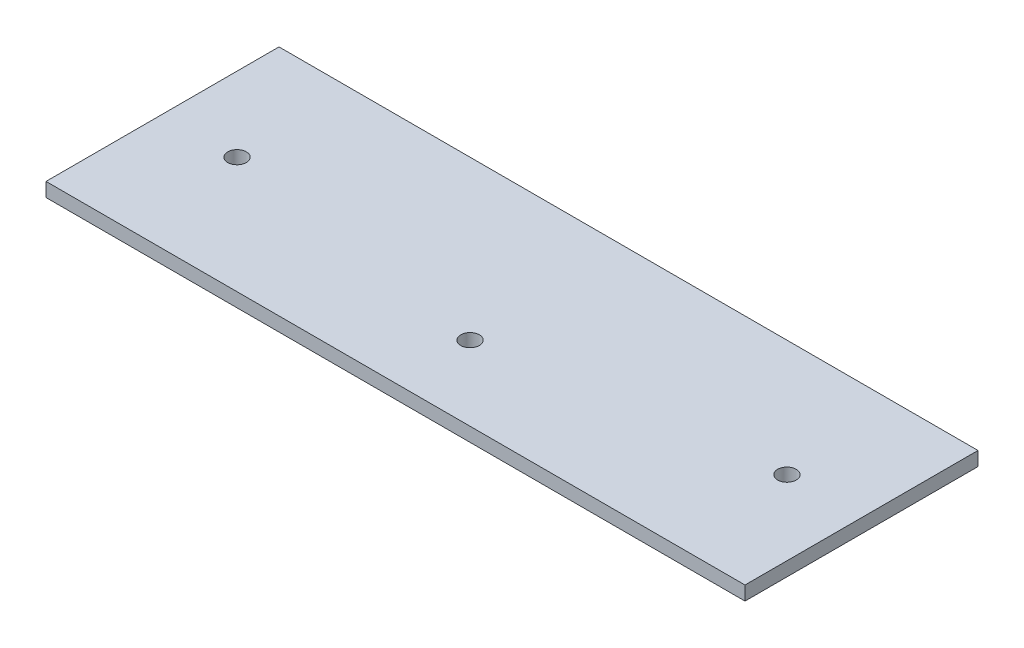
ISO-10303-21;
HEADER;
FILE_DESCRIPTION(('STEP AP214'),'2;1');
FILE_NAME('part.step','',(''),(''),'','','');
FILE_SCHEMA(('AUTOMOTIVE_DESIGN { 1 0 10303 214 1 1 1 1 }'));
ENDSEC;
DATA;
#1=APPLICATION_CONTEXT('core data for automotive mechanical design processes');
#2=APPLICATION_PROTOCOL_DEFINITION('international standard','automotive_design',2000,#1);
#3=PRODUCT_CONTEXT('',#1,'mechanical');
#4=PRODUCT('Part','Part','',(#3));
#5=PRODUCT_RELATED_PRODUCT_CATEGORY('part','',(#4));
#6=PRODUCT_DEFINITION_FORMATION('','',#4);
#7=PRODUCT_DEFINITION_CONTEXT('part definition',#1,'design');
#8=PRODUCT_DEFINITION('design','',#6,#7);
#9=PRODUCT_DEFINITION_SHAPE('','',#8);
#10=(LENGTH_UNIT() NAMED_UNIT(*) SI_UNIT(.MILLI.,.METRE.));
#11=(NAMED_UNIT(*) PLANE_ANGLE_UNIT() SI_UNIT($,.RADIAN.));
#12=(NAMED_UNIT(*) SI_UNIT($,.STERADIAN.) SOLID_ANGLE_UNIT());
#13=UNCERTAINTY_MEASURE_WITH_UNIT(LENGTH_MEASURE(1.E-05),#10,'distance_accuracy_value','');
#14=(GEOMETRIC_REPRESENTATION_CONTEXT(3) GLOBAL_UNCERTAINTY_ASSIGNED_CONTEXT((#13)) GLOBAL_UNIT_ASSIGNED_CONTEXT((#10,
#11,#12)) REPRESENTATION_CONTEXT('',''));
#15=CARTESIAN_POINT('',(0.,0.,0.));
#16=DIRECTION('',(0.,0.,1.));
#17=DIRECTION('',(1.,0.,0.));
#18=AXIS2_PLACEMENT_3D('',#15,#16,#17);
#19=CARTESIAN_POINT('',(-75.,3.,-25.));
#20=DIRECTION('',(1.,0.,0.));
#21=DIRECTION('',(0.,0.,-1.));
#22=AXIS2_PLACEMENT_3D('',#19,#20,#21);
#23=PLANE('',#22);
#24=DIRECTION('',(0.,0.,1.));
#25=VECTOR('',#24,1.);
#26=CARTESIAN_POINT('',(-75.,0.,-25.));
#27=LINE('',#26,#25);
#28=CARTESIAN_POINT('',(-75.,0.,-25.));
#29=VERTEX_POINT('',#28);
#30=CARTESIAN_POINT('',(-75.,0.,25.));
#31=VERTEX_POINT('',#30);
#32=EDGE_CURVE('E98',#29,#31,#27,.T.);
#33=ORIENTED_EDGE('',*,*,#32,.T.);
#34=DIRECTION('',(0.,-1.,0.));
#35=VECTOR('',#34,1.);
#36=CARTESIAN_POINT('',(-75.,3.,25.));
#37=LINE('',#36,#35);
#38=CARTESIAN_POINT('',(-75.,3.,25.));
#39=VERTEX_POINT('',#38);
#40=EDGE_CURVE('E11',#39,#31,#37,.T.);
#41=ORIENTED_EDGE('',*,*,#40,.F.);
#42=DIRECTION('',(0.,0.,1.));
#43=VECTOR('',#42,1.);
#44=CARTESIAN_POINT('',(-75.,3.,-25.));
#45=LINE('',#44,#43);
#46=CARTESIAN_POINT('',(-75.,3.,-25.));
#47=VERTEX_POINT('',#46);
#48=EDGE_CURVE('E86',#47,#39,#45,.T.);
#49=ORIENTED_EDGE('',*,*,#48,.F.);
#50=DIRECTION('',(0.,-1.,0.));
#51=VECTOR('',#50,1.);
#52=CARTESIAN_POINT('',(-75.,3.,-25.));
#53=LINE('',#52,#51);
#54=EDGE_CURVE('E94',#47,#29,#53,.T.);
#55=ORIENTED_EDGE('',*,*,#54,.T.);
#56=EDGE_LOOP('',(#33,#41,#49,#55));
#57=FACE_BOUND('',#56,.T.);
#58=ADVANCED_FACE('F35',(#57),#23,.F.);
#59=CARTESIAN_POINT('',(75.,3.,25.));
#60=DIRECTION('',(0.,0.,-1.));
#61=DIRECTION('',(-1.,0.,0.));
#62=AXIS2_PLACEMENT_3D('',#59,#60,#61);
#63=PLANE('',#62);
#64=DIRECTION('',(1.,0.,0.));
#65=VECTOR('',#64,1.);
#66=CARTESIAN_POINT('',(75.,0.,25.));
#67=LINE('',#66,#65);
#68=CARTESIAN_POINT('',(75.,0.,25.));
#69=VERTEX_POINT('',#68);
#70=EDGE_CURVE('E90',#31,#69,#67,.T.);
#71=ORIENTED_EDGE('',*,*,#70,.T.);
#72=DIRECTION('',(0.,-1.,0.));
#73=VECTOR('',#72,1.);
#74=CARTESIAN_POINT('',(75.,3.,25.));
#75=LINE('',#74,#73);
#76=CARTESIAN_POINT('',(75.,3.,25.));
#77=VERTEX_POINT('',#76);
#78=EDGE_CURVE('E43',#77,#69,#75,.T.);
#79=ORIENTED_EDGE('',*,*,#78,.F.);
#80=DIRECTION('',(1.,0.,0.));
#81=VECTOR('',#80,1.);
#82=CARTESIAN_POINT('',(75.,3.,25.));
#83=LINE('',#82,#81);
#84=EDGE_CURVE('E81',#39,#77,#83,.T.);
#85=ORIENTED_EDGE('',*,*,#84,.F.);
#86=ORIENTED_EDGE('',*,*,#40,.T.);
#87=EDGE_LOOP('',(#71,#79,#85,#86));
#88=FACE_BOUND('',#87,.T.);
#89=ADVANCED_FACE('F89',(#88),#63,.F.);
#90=CARTESIAN_POINT('',(75.,3.,-25.));
#91=DIRECTION('',(-1.,0.,0.));
#92=DIRECTION('',(0.,0.,1.));
#93=AXIS2_PLACEMENT_3D('',#90,#91,#92);
#94=PLANE('',#93);
#95=DIRECTION('',(0.,0.,-1.));
#96=VECTOR('',#95,1.);
#97=CARTESIAN_POINT('',(75.,0.,-25.));
#98=LINE('',#97,#96);
#99=CARTESIAN_POINT('',(75.,0.,-25.));
#100=VERTEX_POINT('',#99);
#101=EDGE_CURVE('E68',#69,#100,#98,.T.);
#102=ORIENTED_EDGE('',*,*,#101,.T.);
#103=DIRECTION('',(0.,-1.,0.));
#104=VECTOR('',#103,1.);
#105=CARTESIAN_POINT('',(75.,3.,-25.));
#106=LINE('',#105,#104);
#107=CARTESIAN_POINT('',(75.,3.,-25.));
#108=VERTEX_POINT('',#107);
#109=EDGE_CURVE('E91',#108,#100,#106,.T.);
#110=ORIENTED_EDGE('',*,*,#109,.F.);
#111=DIRECTION('',(0.,0.,-1.));
#112=VECTOR('',#111,1.);
#113=CARTESIAN_POINT('',(75.,3.,-25.));
#114=LINE('',#113,#112);
#115=EDGE_CURVE('E84',#77,#108,#114,.T.);
#116=ORIENTED_EDGE('',*,*,#115,.F.);
#117=ORIENTED_EDGE('',*,*,#78,.T.);
#118=EDGE_LOOP('',(#102,#110,#116,#117));
#119=FACE_BOUND('',#118,.T.);
#120=ADVANCED_FACE('F92',(#119),#94,.F.);
#121=CARTESIAN_POINT('',(75.,3.,-25.));
#122=DIRECTION('',(0.,0.,1.));
#123=DIRECTION('',(1.,0.,0.));
#124=AXIS2_PLACEMENT_3D('',#121,#122,#123);
#125=PLANE('',#124);
#126=DIRECTION('',(-1.,0.,0.));
#127=VECTOR('',#126,1.);
#128=CARTESIAN_POINT('',(75.,0.,-25.));
#129=LINE('',#128,#127);
#130=EDGE_CURVE('E74',#100,#29,#129,.T.);
#131=ORIENTED_EDGE('',*,*,#130,.T.);
#132=ORIENTED_EDGE('',*,*,#54,.F.);
#133=DIRECTION('',(-1.,0.,0.));
#134=VECTOR('',#133,1.);
#135=CARTESIAN_POINT('',(75.,3.,-25.));
#136=LINE('',#135,#134);
#137=EDGE_CURVE('E51',#108,#47,#136,.T.);
#138=ORIENTED_EDGE('',*,*,#137,.F.);
#139=ORIENTED_EDGE('',*,*,#109,.T.);
#140=EDGE_LOOP('',(#131,#132,#138,#139));
#141=FACE_BOUND('',#140,.T.);
#142=ADVANCED_FACE('F106',(#141),#125,.F.);
#143=CARTESIAN_POINT('',(0.,3.,0.));
#144=DIRECTION('',(0.,-1.,0.));
#145=DIRECTION('',(0.,0.,-1.));
#146=AXIS2_PLACEMENT_3D('',#143,#144,#145);
#147=PLANE('',#146);
#148=CARTESIAN_POINT('',(0.,3.,9.00000000000002));
#149=DIRECTION('',(0.,1.,0.));
#150=DIRECTION('',(0.,0.,1.));
#151=AXIS2_PLACEMENT_3D('',#148,#149,#150);
#152=CIRCLE('',#151,2.);
#153=CARTESIAN_POINT('',(0.,3.,11.));
#154=VERTEX_POINT('',#153);
#155=EDGE_CURVE('E123',#154,#154,#152,.T.);
#156=ORIENTED_EDGE('',*,*,#155,.F.);
#157=EDGE_LOOP('',(#156));
#158=FACE_BOUND('',#157,.T.);
#159=CARTESIAN_POINT('',(-59.,3.,0.));
#160=DIRECTION('',(0.,-1.,0.));
#161=DIRECTION('',(0.,0.,1.));
#162=AXIS2_PLACEMENT_3D('',#159,#160,#161);
#163=CIRCLE('',#162,2.);
#164=CARTESIAN_POINT('',(-59.,3.,2.));
#165=VERTEX_POINT('',#164);
#166=EDGE_CURVE('E120',#165,#165,#163,.T.);
#167=ORIENTED_EDGE('',*,*,#166,.T.);
#168=EDGE_LOOP('',(#167));
#169=FACE_BOUND('',#168,.T.);
#170=CARTESIAN_POINT('',(59.,3.,0.));
#171=DIRECTION('',(0.,1.,0.));
#172=DIRECTION('',(0.,0.,1.));
#173=AXIS2_PLACEMENT_3D('',#170,#171,#172);
#174=CIRCLE('',#173,2.);
#175=CARTESIAN_POINT('',(59.,3.,2.));
#176=VERTEX_POINT('',#175);
#177=EDGE_CURVE('E101',#176,#176,#174,.T.);
#178=ORIENTED_EDGE('',*,*,#177,.F.);
#179=EDGE_LOOP('',(#178));
#180=FACE_BOUND('',#179,.T.);
#181=ORIENTED_EDGE('',*,*,#48,.T.);
#182=ORIENTED_EDGE('',*,*,#84,.T.);
#183=ORIENTED_EDGE('',*,*,#115,.T.);
#184=ORIENTED_EDGE('',*,*,#137,.T.);
#185=EDGE_LOOP('',(#181,#182,#183,#184));
#186=FACE_BOUND('',#185,.T.);
#187=ADVANCED_FACE('F82',(#158,#169,#180,#186),#147,.F.);
#188=CARTESIAN_POINT('',(0.,0.,0.));
#189=DIRECTION('',(0.,-1.,0.));
#190=DIRECTION('',(0.,0.,-1.));
#191=AXIS2_PLACEMENT_3D('',#188,#189,#190);
#192=PLANE('',#191);
#193=CARTESIAN_POINT('',(0.,0.,9.00000000000002));
#194=DIRECTION('',(0.,-1.,0.));
#195=DIRECTION('',(0.,0.,-1.));
#196=AXIS2_PLACEMENT_3D('',#193,#194,#195);
#197=CIRCLE('',#196,2.);
#198=CARTESIAN_POINT('',(0.,0.,7.00000000000002));
#199=VERTEX_POINT('',#198);
#200=EDGE_CURVE('E124',#199,#199,#197,.F.);
#201=ORIENTED_EDGE('',*,*,#200,.T.);
#202=EDGE_LOOP('',(#201));
#203=FACE_BOUND('',#202,.T.);
#204=CARTESIAN_POINT('',(-59.,0.,0.));
#205=DIRECTION('',(0.,-1.,0.));
#206=DIRECTION('',(0.,0.,-1.));
#207=AXIS2_PLACEMENT_3D('',#204,#205,#206);
#208=CIRCLE('',#207,2.);
#209=CARTESIAN_POINT('',(-59.,0.,-2.));
#210=VERTEX_POINT('',#209);
#211=EDGE_CURVE('E115',#210,#210,#208,.T.);
#212=ORIENTED_EDGE('',*,*,#211,.F.);
#213=EDGE_LOOP('',(#212));
#214=FACE_BOUND('',#213,.T.);
#215=CARTESIAN_POINT('',(59.,0.,0.));
#216=DIRECTION('',(0.,-1.,0.));
#217=DIRECTION('',(0.,0.,-1.));
#218=AXIS2_PLACEMENT_3D('',#215,#216,#217);
#219=CIRCLE('',#218,2.);
#220=CARTESIAN_POINT('',(59.,0.,-2.));
#221=VERTEX_POINT('',#220);
#222=EDGE_CURVE('E112',#221,#221,#219,.F.);
#223=ORIENTED_EDGE('',*,*,#222,.T.);
#224=EDGE_LOOP('',(#223));
#225=FACE_BOUND('',#224,.T.);
#226=ORIENTED_EDGE('',*,*,#32,.F.);
#227=ORIENTED_EDGE('',*,*,#130,.F.);
#228=ORIENTED_EDGE('',*,*,#101,.F.);
#229=ORIENTED_EDGE('',*,*,#70,.F.);
#230=EDGE_LOOP('',(#226,#227,#228,#229));
#231=FACE_BOUND('',#230,.T.);
#232=ADVANCED_FACE('F109',(#203,#214,#225,#231),#192,.T.);
#233=CARTESIAN_POINT('',(59.,-0.00100000000000013,0.));
#234=DIRECTION('',(0.,1.,0.));
#235=DIRECTION('',(0.,0.,1.));
#236=AXIS2_PLACEMENT_3D('',#233,#234,#235);
#237=CYLINDRICAL_SURFACE('',#236,2.);
#238=ORIENTED_EDGE('',*,*,#222,.F.);
#239=EDGE_LOOP('',(#238));
#240=FACE_BOUND('',#239,.T.);
#241=ORIENTED_EDGE('',*,*,#177,.T.);
#242=EDGE_LOOP('',(#241));
#243=FACE_BOUND('',#242,.T.);
#244=ADVANCED_FACE('F139',(#240,#243),#237,.F.);
#245=CARTESIAN_POINT('',(-59.,-0.00100000000000013,0.));
#246=DIRECTION('',(0.,1.,0.));
#247=DIRECTION('',(0.,0.,1.));
#248=AXIS2_PLACEMENT_3D('',#245,#246,#247);
#249=CYLINDRICAL_SURFACE('',#248,2.);
#250=ORIENTED_EDGE('',*,*,#211,.T.);
#251=EDGE_LOOP('',(#250));
#252=FACE_BOUND('',#251,.T.);
#253=ORIENTED_EDGE('',*,*,#166,.F.);
#254=EDGE_LOOP('',(#253));
#255=FACE_BOUND('',#254,.T.);
#256=ADVANCED_FACE('F141',(#252,#255),#249,.F.);
#257=CARTESIAN_POINT('',(0.,-0.00100000000000013,9.00000000000002));
#258=DIRECTION('',(0.,1.,0.));
#259=DIRECTION('',(0.,0.,1.));
#260=AXIS2_PLACEMENT_3D('',#257,#258,#259);
#261=CYLINDRICAL_SURFACE('',#260,2.);
#262=ORIENTED_EDGE('',*,*,#200,.F.);
#263=EDGE_LOOP('',(#262));
#264=FACE_BOUND('',#263,.T.);
#265=ORIENTED_EDGE('',*,*,#155,.T.);
#266=EDGE_LOOP('',(#265));
#267=FACE_BOUND('',#266,.T.);
#268=ADVANCED_FACE('F130',(#264,#267),#261,.F.);
#269=CLOSED_SHELL('',(#58,#89,#120,#142,#187,#232,#244,#256,#268));
#270=MANIFOLD_SOLID_BREP('B2',#269);
#271=ADVANCED_BREP_SHAPE_REPRESENTATION('',(#18,#270),#14);
#272=SHAPE_DEFINITION_REPRESENTATION(#9,#271);
ENDSEC;
END-ISO-10303-21;
